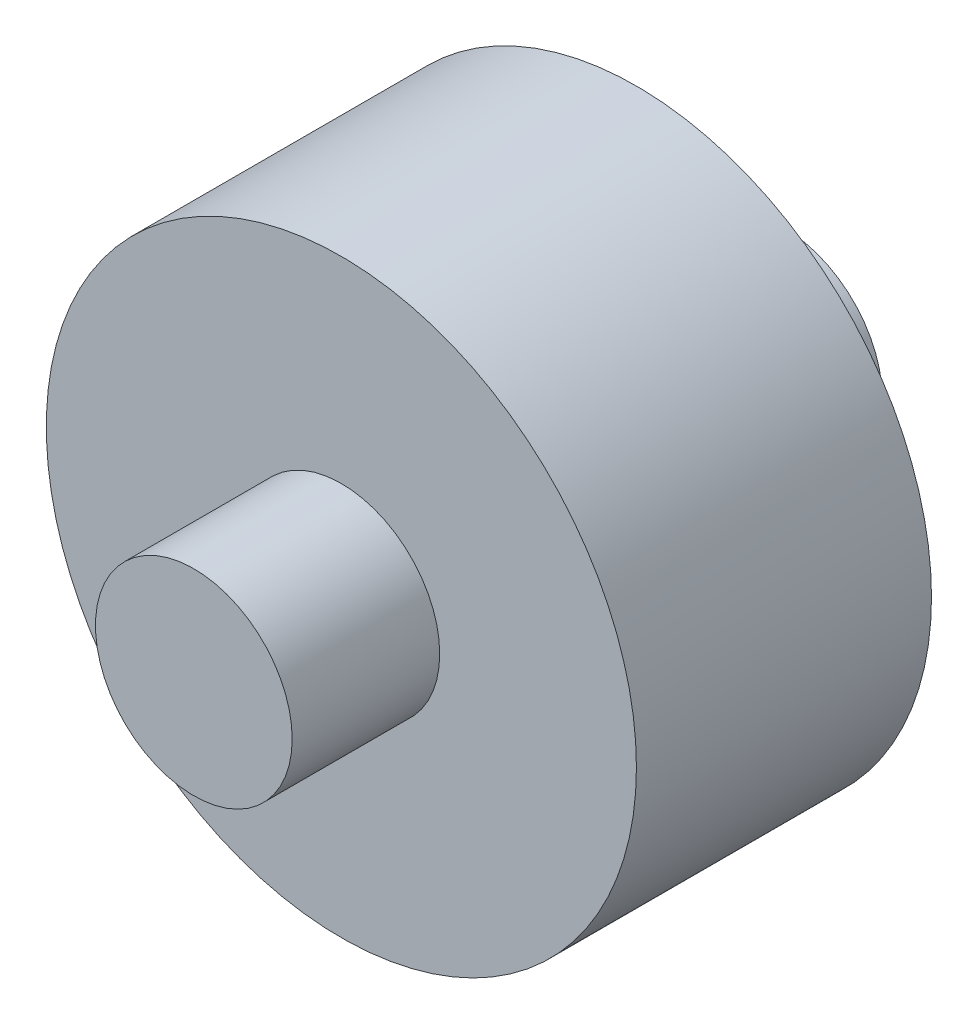
ISO-10303-21;
HEADER;
FILE_DESCRIPTION(('STEP AP214'),'2;1');
FILE_NAME('part.step','',(''),(''),'','','');
FILE_SCHEMA(('AUTOMOTIVE_DESIGN { 1 0 10303 214 1 1 1 1 }'));
ENDSEC;
DATA;
#1=APPLICATION_CONTEXT('core data for automotive mechanical design processes');
#2=APPLICATION_PROTOCOL_DEFINITION('international standard','automotive_design',2000,#1);
#3=PRODUCT_CONTEXT('',#1,'mechanical');
#4=PRODUCT('Part','Part','',(#3));
#5=PRODUCT_RELATED_PRODUCT_CATEGORY('part','',(#4));
#6=PRODUCT_DEFINITION_FORMATION('','',#4);
#7=PRODUCT_DEFINITION_CONTEXT('part definition',#1,'design');
#8=PRODUCT_DEFINITION('design','',#6,#7);
#9=PRODUCT_DEFINITION_SHAPE('','',#8);
#10=(LENGTH_UNIT() NAMED_UNIT(*) SI_UNIT(.MILLI.,.METRE.));
#11=(NAMED_UNIT(*) PLANE_ANGLE_UNIT() SI_UNIT($,.RADIAN.));
#12=(NAMED_UNIT(*) SI_UNIT($,.STERADIAN.) SOLID_ANGLE_UNIT());
#13=UNCERTAINTY_MEASURE_WITH_UNIT(LENGTH_MEASURE(1.E-05),#10,'distance_accuracy_value','');
#14=(GEOMETRIC_REPRESENTATION_CONTEXT(3) GLOBAL_UNCERTAINTY_ASSIGNED_CONTEXT((#13)) GLOBAL_UNIT_ASSIGNED_CONTEXT((#10,
#11,#12)) REPRESENTATION_CONTEXT('',''));
#15=CARTESIAN_POINT('',(0.,0.,0.));
#16=DIRECTION('',(0.,0.,1.));
#17=DIRECTION('',(1.,0.,0.));
#18=AXIS2_PLACEMENT_3D('',#15,#16,#17);
#19=CARTESIAN_POINT('',(0.,0.,4.7625));
#20=DIRECTION('',(0.,0.,-1.));
#21=DIRECTION('',(-1.,0.,0.));
#22=AXIS2_PLACEMENT_3D('',#19,#20,#21);
#23=CYLINDRICAL_SURFACE('',#22,9.525);
#24=CARTESIAN_POINT('',(-9.525,0.,-3.175));
#25=CARTESIAN_POINT('',(-9.52500048580497,0.173238677165346,-3.17500080559796));
#26=CARTESIAN_POINT('',(-9.52023018186455,0.346472492659896,-3.16077515504609));
#27=CARTESIAN_POINT('',(-9.50167042395416,0.687837590771687,-3.10442257950533));
#28=CARTESIAN_POINT('',(-9.48788003366834,0.855968341777246,-3.06229275796217));
#29=CARTESIAN_POINT('',(-9.45277852602955,1.18215660666814,-2.95173640225565));
#30=CARTESIAN_POINT('',(-9.43147998545459,1.34023044718816,-2.88335382669181));
#31=CARTESIAN_POINT('',(-9.3835361515256,1.64266542435691,-2.72243177623825));
#32=CARTESIAN_POINT('',(-9.35688980370195,1.78702384834389,-2.62988753611674));
#33=CARTESIAN_POINT('',(-9.30002249856541,2.0629298181957,-2.41990306957346));
#34=CARTESIAN_POINT('',(-9.26971591772517,2.19393674844713,-2.30177583122293));
#35=CARTESIAN_POINT('',(-9.2094149943641,2.43469379932912,-2.04543928380665));
#36=CARTESIAN_POINT('',(-9.17942072197493,2.54443923892904,-1.90722556410197));
#37=CARTESIAN_POINT('',(-9.12219830615344,2.74264419157345,-1.60977225925124));
#38=CARTESIAN_POINT('',(-9.0950744970031,2.83040092485178,-1.45004237635051));
#39=CARTESIAN_POINT('',(-9.04796594704058,2.97757492456177,-1.11704090009411));
#40=CARTESIAN_POINT('',(-9.02797902810367,3.03700083920298,-0.943773458008289));
#41=CARTESIAN_POINT('',(-8.99830887880273,3.12379824029159,-0.594762521747945));
#42=CARTESIAN_POINT('',(-8.98830104068515,3.15218269826287,-0.419299363047221));
#43=CARTESIAN_POINT('',(-8.97876209798686,3.17925806658696,-0.0658375805550786));
#44=CARTESIAN_POINT('',(-8.97922775597167,3.17795815259498,0.11216024275168));
#45=CARTESIAN_POINT('',(-8.99029872650972,3.14648819425835,0.456998801659767));
#46=CARTESIAN_POINT('',(-9.00043970379417,3.11764017430521,0.623977679267884));
#47=CARTESIAN_POINT('',(-9.02895888275449,3.0340495670469,0.950574107251699));
#48=CARTESIAN_POINT('',(-9.04733807064541,2.97930387942919,1.11019077375635));
#49=CARTESIAN_POINT('',(-9.09059367841715,2.84460650934117,1.42053547995294));
#50=CARTESIAN_POINT('',(-9.11556996393148,2.76426310464556,1.57107898086574));
#51=CARTESIAN_POINT('',(-9.16916373477931,2.58092291251247,1.85696513378813));
#52=CARTESIAN_POINT('',(-9.19778227084722,2.47791958175572,1.99230337801349));
#53=CARTESIAN_POINT('',(-9.25726270107577,2.2458341312661,2.25136582416045));
#54=CARTESIAN_POINT('',(-9.28816371201626,2.11567125149229,2.3741148050663));
#55=CARTESIAN_POINT('',(-9.34742029378841,1.83622813465495,2.59629677165629));
#56=CARTESIAN_POINT('',(-9.37577562033364,1.68694606622309,2.69572752117227));
#57=CARTESIAN_POINT('',(-9.42711817702495,1.3714336714219,2.86923575324634));
#58=CARTESIAN_POINT('',(-9.45004936275524,1.20504990262187,2.94305193500682));
#59=CARTESIAN_POINT('',(-9.4875530068358,0.861279339682311,3.06134507730938));
#60=CARTESIAN_POINT('',(-9.50212836854241,0.683896391141978,3.10583222946941));
#61=CARTESIAN_POINT('',(-9.52079715951823,0.33141865875554,3.16247673962099));
#62=CARTESIAN_POINT('',(-9.52531755822086,0.156557979570887,3.17595189412348));
#63=CARTESIAN_POINT('',(-9.52464766056077,-0.192960847123754,3.17394376132486));
#64=CARTESIAN_POINT('',(-9.51945900331475,-0.36761902383989,3.15846536206389));
#65=CARTESIAN_POINT('',(-9.50023578476806,-0.706500575516011,3.10003219293833));
#66=CARTESIAN_POINT('',(-9.48646180908035,-0.870879661700627,3.05788629579286));
#67=CARTESIAN_POINT('',(-9.45171613685472,-1.19016766849015,2.94832581381814));
#68=CARTESIAN_POINT('',(-9.43074352248193,-1.34507537851482,2.88090800668978));
#69=CARTESIAN_POINT('',(-9.38304356837145,-1.64556534104864,2.7207513789055));
#70=CARTESIAN_POINT('',(-9.35617936849621,-1.79079512051444,2.62739316632593));
#71=CARTESIAN_POINT('',(-9.29974181184133,-2.06395583568049,2.41873357370719));
#72=CARTESIAN_POINT('',(-9.27016762910402,-2.19188146775095,2.30342549209915));
#73=CARTESIAN_POINT('',(-9.20993992337912,-2.432851712285,2.04794246555408));
#74=CARTESIAN_POINT('',(-9.17929841452584,-2.54495607735532,1.90687570450722));
#75=CARTESIAN_POINT('',(-9.121774152107,-2.74401763337735,1.60727527220043));
#76=CARTESIAN_POINT('',(-9.09489142987857,-2.83097461468097,1.44874145533681));
#77=CARTESIAN_POINT('',(-9.04819093937643,-2.97687025407195,1.11863817645458));
#78=CARTESIAN_POINT('',(-9.02835890517707,-3.03586556962394,0.94709589863917));
#79=CARTESIAN_POINT('',(-8.99829392572977,-3.12386556696095,0.595697786109886));
#80=CARTESIAN_POINT('',(-8.98805665630055,-3.15288375947876,0.415845734841191));
#81=CARTESIAN_POINT('',(-8.97883201925512,-3.17905219686556,0.0628742200700919));
#82=CARTESIAN_POINT('',(-8.97929370817293,-3.17776306695417,-0.110116430410663));
#83=CARTESIAN_POINT('',(-8.99005281690779,-3.1471942816996,-0.453279112877547));
#84=CARTESIAN_POINT('',(-9.00034965132723,-3.11791629228101,-0.623451312007405));
#85=CARTESIAN_POINT('',(-9.02920864668031,-3.03330550668567,-0.952930730032849));
#86=CARTESIAN_POINT('',(-9.04761011221366,-2.97847812359926,-1.11238291938927));
#87=CARTESIAN_POINT('',(-9.09054566248638,-2.8447344862872,-1.419947017029));
#88=CARTESIAN_POINT('',(-9.11508110823773,-2.76581288515833,-1.56805639902192));
#89=CARTESIAN_POINT('',(-9.16885482792697,-2.58210269895239,-1.85573565200524));
#90=CARTESIAN_POINT('',(-9.19825159463785,-2.47633567077754,-1.99465089352737));
#91=CARTESIAN_POINT('',(-9.25777156199328,-2.24359115395568,-2.25326515749483));
#92=CARTESIAN_POINT('',(-9.28789496596782,-2.11660766813346,-2.37295872780964));
#93=CARTESIAN_POINT('',(-9.34688346918603,-1.83909194322319,-2.59443350901814));
#94=CARTESIAN_POINT('',(-9.3756537721899,-1.68783480536164,-2.69533480410942));
#95=CARTESIAN_POINT('',(-9.42740021973043,-1.36955960976604,-2.8701696116008));
#96=CARTESIAN_POINT('',(-9.45037784507677,-1.20254559507021,-2.94411001830248));
#97=CARTESIAN_POINT('',(-9.4870751034262,-0.865167329863099,-3.05981618315153));
#98=CARTESIAN_POINT('',(-9.50116249441509,-0.695286130622597,-3.10287183038622));
#99=CARTESIAN_POINT('',(-9.52012342428904,-0.350267320832534,-3.16045939114988));
#100=CARTESIAN_POINT('',(-9.52499950888798,-0.17513117618077,-3.1749991856015));
#101=CARTESIAN_POINT('',(-9.525,0.,-3.175));
#102=B_SPLINE_CURVE_WITH_KNOTS('',3,(#24,#25,#26,#27,#28,#29,#30,#31,#32,#33,#34,#35,#36,#37,
#38,#39,#40,#41,#42,#43,#44,#45,#46,#47,#48,#49,#50,#51,#52,#53,#54,#55,#56,#57,#58,#59,#60,#61,
#62,#63,#64,#65,#66,#67,#68,#69,#70,#71,#72,#73,#74,#75,#76,#77,#78,#79,#80,#81,#82,#83,#84,#85,
#86,#87,#88,#89,#90,#91,#92,#93,#94,#95,#96,#97,#98,#99,#100,#101),.UNSPECIFIED.,.T.,.F.,(4,2,2,
2,2,2,2,2,2,2,2,2,2,2,2,2,2,2,2,2,2,2,2,2,2,2,2,2,2,2,2,2,2,2,2,2,2,2,4),(0.,0.519071561632585,
1.03819701322438,1.55645698636312,2.07481924951214,2.6093637259775,3.14402575687909,
3.69406121814519,4.24392866899746,4.77526114230342,5.30642937910266,5.81332424300315,
6.32027980466155,6.8353994341754,7.35066800622308,7.8928374595109,8.43505888444013,
8.98265937939885,9.53006948685136,10.0537512658116,10.5773446429626,11.0857715158083,
11.5942632377703,12.1161301950386,12.638156741095,13.1839024764639,13.7296527614611,
14.274292439,14.8186865394104,15.3351123975402,15.8515075194062,16.3580948898032,
16.8647947620873,17.3936046174648,17.92256420318,18.4721392315144,19.0215736265905,
19.5464607283686,20.0712027467109),.UNSPECIFIED.);
#103=CARTESIAN_POINT('',(-9.525,0.,-3.175));
#104=VERTEX_POINT('',#103);
#105=EDGE_CURVE('E10',#104,#104,#102,.T.);
#106=ORIENTED_EDGE('',*,*,#105,.T.);
#107=EDGE_LOOP('',(#106));
#108=FACE_BOUND('',#107,.T.);
#109=CARTESIAN_POINT('',(0.,0.,4.7625));
#110=DIRECTION('',(0.,0.,1.));
#111=DIRECTION('',(1.,0.,0.));
#112=AXIS2_PLACEMENT_3D('',#109,#110,#111);
#113=CIRCLE('',#112,9.525);
#114=CARTESIAN_POINT('',(9.525,0.,4.7625));
#115=VERTEX_POINT('',#114);
#116=EDGE_CURVE('E49',#115,#115,#113,.T.);
#117=ORIENTED_EDGE('',*,*,#116,.F.);
#118=EDGE_LOOP('',(#117));
#119=FACE_BOUND('',#118,.T.);
#120=CARTESIAN_POINT('',(0.,0.,-4.7625));
#121=DIRECTION('',(0.,0.,1.));
#122=DIRECTION('',(1.,0.,0.));
#123=AXIS2_PLACEMENT_3D('',#120,#121,#122);
#124=CIRCLE('',#123,9.525);
#125=CARTESIAN_POINT('',(9.525,0.,-4.7625));
#126=VERTEX_POINT('',#125);
#127=EDGE_CURVE('E53',#126,#126,#124,.T.);
#128=ORIENTED_EDGE('',*,*,#127,.T.);
#129=EDGE_LOOP('',(#128));
#130=FACE_BOUND('',#129,.T.);
#131=ADVANCED_FACE('F34',(#108,#119,#130),#23,.T.);
#132=CARTESIAN_POINT('',(0.,0.,4.7625));
#133=DIRECTION('',(0.,0.,1.));
#134=DIRECTION('',(1.,0.,0.));
#135=AXIS2_PLACEMENT_3D('',#132,#133,#134);
#136=PLANE('',#135);
#137=CARTESIAN_POINT('',(0.,0.,4.7625));
#138=DIRECTION('',(0.,0.,1.));
#139=DIRECTION('',(1.,0.,0.));
#140=AXIS2_PLACEMENT_3D('',#137,#138,#139);
#141=CIRCLE('',#140,3.175);
#142=CARTESIAN_POINT('',(3.175,0.,4.7625));
#143=VERTEX_POINT('',#142);
#144=EDGE_CURVE('E57',#143,#143,#141,.F.);
#145=ORIENTED_EDGE('',*,*,#144,.T.);
#146=EDGE_LOOP('',(#145));
#147=FACE_BOUND('',#146,.T.);
#148=ORIENTED_EDGE('',*,*,#116,.T.);
#149=EDGE_LOOP('',(#148));
#150=FACE_BOUND('',#149,.T.);
#151=ADVANCED_FACE('F82',(#147,#150),#136,.T.);
#152=CARTESIAN_POINT('',(0.,0.,-4.7625));
#153=DIRECTION('',(0.,0.,1.));
#154=DIRECTION('',(1.,0.,0.));
#155=AXIS2_PLACEMENT_3D('',#152,#153,#154);
#156=PLANE('',#155);
#157=CARTESIAN_POINT('',(0.,0.,-4.7625));
#158=DIRECTION('',(0.,0.,1.));
#159=DIRECTION('',(1.,0.,0.));
#160=AXIS2_PLACEMENT_3D('',#157,#158,#159);
#161=CIRCLE('',#160,3.175);
#162=CARTESIAN_POINT('',(3.175,0.,-4.7625));
#163=VERTEX_POINT('',#162);
#164=EDGE_CURVE('E45',#163,#163,#161,.F.);
#165=ORIENTED_EDGE('',*,*,#164,.F.);
#166=EDGE_LOOP('',(#165));
#167=FACE_BOUND('',#166,.T.);
#168=ORIENTED_EDGE('',*,*,#127,.F.);
#169=EDGE_LOOP('',(#168));
#170=FACE_BOUND('',#169,.T.);
#171=ADVANCED_FACE('F86',(#167,#170),#156,.F.);
#172=CARTESIAN_POINT('',(0.,0.,-9.525));
#173=DIRECTION('',(0.,0.,1.));
#174=DIRECTION('',(1.,0.,0.));
#175=AXIS2_PLACEMENT_3D('',#172,#173,#174);
#176=PLANE('',#175);
#177=CARTESIAN_POINT('',(0.,0.,-9.525));
#178=DIRECTION('',(0.,0.,1.));
#179=DIRECTION('',(1.,0.,0.));
#180=AXIS2_PLACEMENT_3D('',#177,#178,#179);
#181=CIRCLE('',#180,3.175);
#182=CARTESIAN_POINT('',(3.175,0.,-9.525));
#183=VERTEX_POINT('',#182);
#184=EDGE_CURVE('E62',#183,#183,#181,.T.);
#185=ORIENTED_EDGE('',*,*,#184,.F.);
#186=EDGE_LOOP('',(#185));
#187=FACE_BOUND('',#186,.T.);
#188=ADVANCED_FACE('F95',(#187),#176,.F.);
#189=CARTESIAN_POINT('',(0.,0.,9.525));
#190=DIRECTION('',(0.,0.,-1.));
#191=DIRECTION('',(-1.,0.,0.));
#192=AXIS2_PLACEMENT_3D('',#189,#190,#191);
#193=CYLINDRICAL_SURFACE('',#192,3.175);
#194=ORIENTED_EDGE('',*,*,#184,.T.);
#195=EDGE_LOOP('',(#194));
#196=FACE_BOUND('',#195,.T.);
#197=ORIENTED_EDGE('',*,*,#164,.T.);
#198=EDGE_LOOP('',(#197));
#199=FACE_BOUND('',#198,.T.);
#200=ADVANCED_FACE('F100',(#196,#199),#193,.T.);
#201=ORIENTED_EDGE('',*,*,#144,.F.);
#202=EDGE_LOOP('',(#201));
#203=FACE_BOUND('',#202,.T.);
#204=CARTESIAN_POINT('',(0.,0.,9.525));
#205=DIRECTION('',(0.,0.,1.));
#206=DIRECTION('',(1.,0.,0.));
#207=AXIS2_PLACEMENT_3D('',#204,#205,#206);
#208=CIRCLE('',#207,3.175);
#209=CARTESIAN_POINT('',(3.175,0.,9.525));
#210=VERTEX_POINT('',#209);
#211=EDGE_CURVE('E61',#210,#210,#208,.T.);
#212=ORIENTED_EDGE('',*,*,#211,.F.);
#213=EDGE_LOOP('',(#212));
#214=FACE_BOUND('',#213,.T.);
#215=ADVANCED_FACE('F104',(#203,#214),#193,.T.);
#216=CARTESIAN_POINT('',(0.,0.,9.525));
#217=DIRECTION('',(0.,0.,1.));
#218=DIRECTION('',(1.,0.,0.));
#219=AXIS2_PLACEMENT_3D('',#216,#217,#218);
#220=PLANE('',#219);
#221=ORIENTED_EDGE('',*,*,#211,.T.);
#222=EDGE_LOOP('',(#221));
#223=FACE_BOUND('',#222,.T.);
#224=ADVANCED_FACE('F80',(#223),#220,.T.);
#225=CARTESIAN_POINT('',(-9.525,0.,0.));
#226=DIRECTION('',(1.,0.,0.));
#227=DIRECTION('',(0.,0.,-1.));
#228=AXIS2_PLACEMENT_3D('',#225,#226,#227);
#229=CYLINDRICAL_SURFACE('',#228,3.175);
#230=CARTESIAN_POINT('',(0.,0.,0.));
#231=DIRECTION('',(1.,0.,0.));
#232=DIRECTION('',(0.,0.,-1.));
#233=AXIS2_PLACEMENT_3D('',#230,#231,#232);
#234=CIRCLE('',#233,3.175);
#235=CARTESIAN_POINT('',(0.,0.,-3.175));
#236=VERTEX_POINT('',#235);
#237=EDGE_CURVE('E65',#236,#236,#234,.T.);
#238=ORIENTED_EDGE('',*,*,#237,.T.);
#239=EDGE_LOOP('',(#238));
#240=FACE_BOUND('',#239,.T.);
#241=ORIENTED_EDGE('',*,*,#105,.F.);
#242=EDGE_LOOP('',(#241));
#243=FACE_BOUND('',#242,.T.);
#244=ADVANCED_FACE('F71',(#240,#243),#229,.F.);
#245=CARTESIAN_POINT('',(0.,0.,0.));
#246=DIRECTION('',(1.,0.,0.));
#247=DIRECTION('',(0.,0.,-1.));
#248=AXIS2_PLACEMENT_3D('',#245,#246,#247);
#249=PLANE('',#248);
#250=ORIENTED_EDGE('',*,*,#237,.F.);
#251=EDGE_LOOP('',(#250));
#252=FACE_BOUND('',#251,.T.);
#253=ADVANCED_FACE('F74',(#252),#249,.F.);
#254=CLOSED_SHELL('',(#131,#151,#171,#188,#200,#215,#224,#244,#253));
#255=MANIFOLD_SOLID_BREP('B2',#254);
#256=ADVANCED_BREP_SHAPE_REPRESENTATION('',(#18,#255),#14);
#257=SHAPE_DEFINITION_REPRESENTATION(#9,#256);
ENDSEC;
END-ISO-10303-21;
